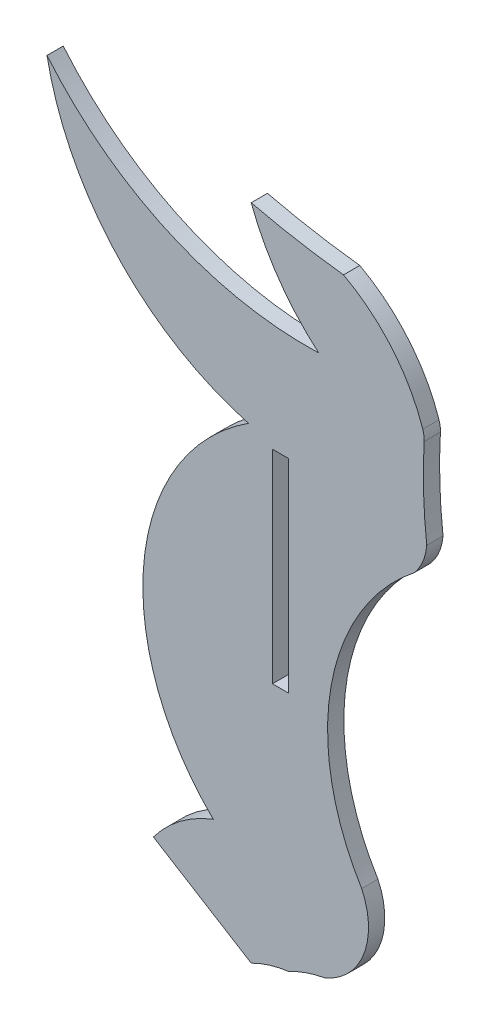
ISO-10303-21;
HEADER;
FILE_DESCRIPTION(('STEP AP214'),'2;1');
FILE_NAME('part.step','',(''),(''),'','','');
FILE_SCHEMA(('AUTOMOTIVE_DESIGN { 1 0 10303 214 1 1 1 1 }'));
ENDSEC;
DATA;
#1=APPLICATION_CONTEXT('core data for automotive mechanical design processes');
#2=APPLICATION_PROTOCOL_DEFINITION('international standard','automotive_design',2000,#1);
#3=PRODUCT_CONTEXT('',#1,'mechanical');
#4=PRODUCT('Part','Part','',(#3));
#5=PRODUCT_RELATED_PRODUCT_CATEGORY('part','',(#4));
#6=PRODUCT_DEFINITION_FORMATION('','',#4);
#7=PRODUCT_DEFINITION_CONTEXT('part definition',#1,'design');
#8=PRODUCT_DEFINITION('design','',#6,#7);
#9=PRODUCT_DEFINITION_SHAPE('','',#8);
#10=(LENGTH_UNIT() NAMED_UNIT(*) SI_UNIT(.MILLI.,.METRE.));
#11=(NAMED_UNIT(*) PLANE_ANGLE_UNIT() SI_UNIT($,.RADIAN.));
#12=(NAMED_UNIT(*) SI_UNIT($,.STERADIAN.) SOLID_ANGLE_UNIT());
#13=UNCERTAINTY_MEASURE_WITH_UNIT(LENGTH_MEASURE(1.E-05),#10,'distance_accuracy_value','');
#14=(GEOMETRIC_REPRESENTATION_CONTEXT(3) GLOBAL_UNCERTAINTY_ASSIGNED_CONTEXT((#13)) GLOBAL_UNIT_ASSIGNED_CONTEXT((#10,
#11,#12)) REPRESENTATION_CONTEXT('',''));
#15=CARTESIAN_POINT('',(0.,0.,0.));
#16=DIRECTION('',(0.,0.,1.));
#17=DIRECTION('',(1.,0.,0.));
#18=AXIS2_PLACEMENT_3D('',#15,#16,#17);
#19=CARTESIAN_POINT('',(9.55454090485293,-191.285070847435,1.524));
#20=DIRECTION('',(0.,0.,1.));
#21=DIRECTION('',(1.,0.,0.));
#22=AXIS2_PLACEMENT_3D('',#19,#20,#21);
#23=PLANE('',#22);
#24=CARTESIAN_POINT('',(9.55454090485293,-191.285070847435,1.524));
#25=DIRECTION('',(0.,0.,1.));
#26=DIRECTION('',(1.,0.,0.));
#27=AXIS2_PLACEMENT_3D('',#24,#25,#26);
#28=CIRCLE('',#27,21.7056422782127);
#29=CARTESIAN_POINT('',(-2.25421514068314,-173.072762169874,1.524));
#30=VERTEX_POINT('',#29);
#31=CARTESIAN_POINT('',(-5.54862103241916,-206.874471291527,1.524));
#32=VERTEX_POINT('',#31);
#33=EDGE_CURVE('E206',#30,#32,#28,.T.);
#34=ORIENTED_EDGE('',*,*,#33,.T.);
#35=CARTESIAN_POINT('',(-1.05625421100928,-218.650257011627,1.524));
#36=DIRECTION('',(0.,0.,1.));
#37=DIRECTION('',(1.,0.,0.));
#38=AXIS2_PLACEMENT_3D('',#35,#36,#37);
#39=CIRCLE('',#38,12.6035903211671);
#40=CARTESIAN_POINT('',(-11.1636350603326,-211.120891742858,1.524));
#41=VERTEX_POINT('',#40);
#42=EDGE_CURVE('E209',#32,#41,#39,.T.);
#43=ORIENTED_EDGE('',*,*,#42,.T.);
#44=DIRECTION('',(0.850986149629736,-0.525188131185728,0.));
#45=VECTOR('',#44,1.);
#46=CARTESIAN_POINT('',(-11.1636350603326,-211.120891742858,1.524));
#47=LINE('',#46,#45);
#48=CARTESIAN_POINT('',(-1.99294998058961,-216.78060190479,1.524));
#49=VERTEX_POINT('',#48);
#50=EDGE_CURVE('E212',#41,#49,#47,.T.);
#51=ORIENTED_EDGE('',*,*,#50,.T.);
#52=CARTESIAN_POINT('',(2.86907927883287,-226.347107534115,1.524));
#53=DIRECTION('',(0.,0.,-1.));
#54=DIRECTION('',(-1.,0.,0.));
#55=AXIS2_PLACEMENT_3D('',#52,#53,#54);
#56=CIRCLE('',#55,10.7311396633995);
#57=CARTESIAN_POINT('',(1.524,-215.700600115763,1.524));
#58=VERTEX_POINT('',#57);
#59=EDGE_CURVE('E214',#49,#58,#56,.T.);
#60=ORIENTED_EDGE('',*,*,#59,.T.);
#61=CARTESIAN_POINT('',(6.91537361239495,-225.789435181501,1.524));
#62=DIRECTION('',(0.,0.,-1.));
#63=DIRECTION('',(1.,0.,0.));
#64=AXIS2_PLACEMENT_3D('',#61,#62,#63);
#65=CIRCLE('',#64,11.4390341555616);
#66=CARTESIAN_POINT('',(4.91126657872368,-214.527328033649,1.524));
#67=VERTEX_POINT('',#66);
#68=EDGE_CURVE('E216',#58,#67,#65,.T.);
#69=ORIENTED_EDGE('',*,*,#68,.T.);
#70=CARTESIAN_POINT('',(2.37198795819861,-208.395239811144,1.524));
#71=DIRECTION('',(0.,0.,1.));
#72=DIRECTION('',(-1.,0.,0.));
#73=AXIS2_PLACEMENT_3D('',#70,#71,#72);
#74=CIRCLE('',#73,6.6370506914778);
#75=CARTESIAN_POINT('',(8.36625056807107,-205.545808702109,1.524));
#76=VERTEX_POINT('',#75);
#77=EDGE_CURVE('E218',#67,#76,#74,.T.);
#78=ORIENTED_EDGE('',*,*,#77,.T.);
#79=CARTESIAN_POINT('',(26.6766710158439,-194.264083119779,1.524));
#80=DIRECTION('',(0.,0.,-1.));
#81=DIRECTION('',(1.,0.,0.));
#82=AXIS2_PLACEMENT_3D('',#79,#80,#81);
#83=CIRCLE('',#82,21.5069483909087);
#84=CARTESIAN_POINT('',(13.3114033214699,-177.414203341368,1.524));
#85=VERTEX_POINT('',#84);
#86=EDGE_CURVE('E220',#76,#85,#83,.T.);
#87=ORIENTED_EDGE('',*,*,#86,.T.);
#88=CARTESIAN_POINT('',(9.55284362416833,-174.220966814508,1.524));
#89=DIRECTION('',(0.,0.,1.));
#90=DIRECTION('',(-1.,0.,0.));
#91=AXIS2_PLACEMENT_3D('',#88,#89,#90);
#92=CIRCLE('',#91,4.93188914257544);
#93=CARTESIAN_POINT('',(14.4684042680822,-174.621958174336,1.524));
#94=VERTEX_POINT('',#93);
#95=EDGE_CURVE('E222',#85,#94,#92,.T.);
#96=ORIENTED_EDGE('',*,*,#95,.T.);
#97=CARTESIAN_POINT('',(63.0675660835477,-169.034269570915,1.524));
#98=DIRECTION('',(0.,0.,-1.));
#99=DIRECTION('',(1.,0.,0.));
#100=AXIS2_PLACEMENT_3D('',#97,#98,#99);
#101=CIRCLE('',#100,48.9193294424055);
#102=CARTESIAN_POINT('',(14.2231544027315,-166.327936138102,1.524));
#103=VERTEX_POINT('',#102);
#104=EDGE_CURVE('E224',#94,#103,#101,.T.);
#105=ORIENTED_EDGE('',*,*,#104,.T.);
#106=CARTESIAN_POINT('',(11.6870442989541,-166.187417308475,1.524));
#107=DIRECTION('',(0.,0.,1.));
#108=DIRECTION('',(1.,0.,0.));
#109=AXIS2_PLACEMENT_3D('',#106,#107,#108);
#110=CIRCLE('',#109,2.53999999999246);
#111=CARTESIAN_POINT('',(14.0945005026066,-165.377630529468,1.524));
#112=VERTEX_POINT('',#111);
#113=EDGE_CURVE('E226',#103,#112,#110,.T.);
#114=ORIENTED_EDGE('',*,*,#113,.T.);
#115=CARTESIAN_POINT('',(-0.795742059191459,-170.386204120323,1.524));
#116=DIRECTION('',(0.,0.,1.));
#117=DIRECTION('',(-1.,0.,0.));
#118=AXIS2_PLACEMENT_3D('',#115,#116,#117);
#119=CIRCLE('',#118,15.7100328759744);
#120=CARTESIAN_POINT('',(6.66463399306705,-156.560578560405,1.524));
#121=VERTEX_POINT('',#120);
#122=EDGE_CURVE('E228',#112,#121,#119,.T.);
#123=ORIENTED_EDGE('',*,*,#122,.T.);
#124=CARTESIAN_POINT('',(15.1562114467351,-83.2693623241411,1.524));
#125=DIRECTION('',(0.,0.,-1.));
#126=DIRECTION('',(1.,0.,0.));
#127=AXIS2_PLACEMENT_3D('',#124,#125,#126);
#128=CIRCLE('',#127,73.7814967660753);
#129=CARTESIAN_POINT('',(-1.99294998058962,-155.03018399852,1.524));
#130=VERTEX_POINT('',#129);
#131=EDGE_CURVE('E230',#121,#130,#128,.T.);
#132=ORIENTED_EDGE('',*,*,#131,.T.);
#133=CARTESIAN_POINT('',(18.7780162943686,-147.215121239974,1.524));
#134=DIRECTION('',(0.,0.,1.));
#135=DIRECTION('',(-1.,0.,0.));
#136=AXIS2_PLACEMENT_3D('',#133,#134,#135);
#137=CIRCLE('',#136,22.1925268033058);
#138=CARTESIAN_POINT('',(4.33054086219458,-164.06085362394,1.524));
#139=VERTEX_POINT('',#138);
#140=EDGE_CURVE('E232',#130,#139,#137,.T.);
#141=ORIENTED_EDGE('',*,*,#140,.T.);
#142=CARTESIAN_POINT('',(3.23415918320192,-132.391414568045,1.524));
#143=DIRECTION('',(0.,0.,-1.));
#144=DIRECTION('',(1.,0.,0.));
#145=AXIS2_PLACEMENT_3D('',#142,#143,#144);
#146=CIRCLE('',#145,31.6884114922331);
#147=CARTESIAN_POINT('',(-21.1397618321882,-152.641535487106,1.524));
#148=VERTEX_POINT('',#147);
#149=EDGE_CURVE('E234',#139,#148,#146,.T.);
#150=ORIENTED_EDGE('',*,*,#149,.T.);
#151=CARTESIAN_POINT('',(4.7413016089885,-147.662461796435,1.524));
#152=DIRECTION('',(0.,0.,1.));
#153=DIRECTION('',(-1.,0.,0.));
#154=AXIS2_PLACEMENT_3D('',#151,#152,#153);
#155=CIRCLE('',#154,26.3556563125138);
#156=EDGE_CURVE('E236',#148,#30,#155,.T.);
#157=ORIENTED_EDGE('',*,*,#156,.T.);
#158=EDGE_LOOP('',(#34,#43,#51,#60,#69,#78,#87,#96,#105,#114,#123,#132,#141,#150,#157));
#159=FACE_BOUND('',#158,.T.);
#160=DIRECTION('',(-1.,0.,0.));
#161=VECTOR('',#160,1.);
#162=CARTESIAN_POINT('',(1.52400000000001,-174.049694422532,1.524));
#163=LINE('',#162,#161);
#164=CARTESIAN_POINT('',(1.52400000000001,-174.049694422532,1.524));
#165=VERTEX_POINT('',#164);
#166=CARTESIAN_POINT('',(0.,-174.049694422532,1.524));
#167=VERTEX_POINT('',#166);
#168=EDGE_CURVE('E178',#165,#167,#163,.T.);
#169=ORIENTED_EDGE('',*,*,#168,.F.);
#170=DIRECTION('',(0.,1.,0.));
#171=VECTOR('',#170,1.);
#172=CARTESIAN_POINT('',(1.52400000000001,-174.049694422532,1.524));
#173=LINE('',#172,#171);
#174=CARTESIAN_POINT('',(1.52400000000001,-193.099694422531,1.524));
#175=VERTEX_POINT('',#174);
#176=EDGE_CURVE('E170',#175,#165,#173,.T.);
#177=ORIENTED_EDGE('',*,*,#176,.F.);
#178=DIRECTION('',(1.,0.,0.));
#179=VECTOR('',#178,1.);
#180=CARTESIAN_POINT('',(1.52400000000001,-193.099694422531,1.524));
#181=LINE('',#180,#179);
#182=CARTESIAN_POINT('',(0.,-193.099694422531,1.524));
#183=VERTEX_POINT('',#182);
#184=EDGE_CURVE('E192',#183,#175,#181,.T.);
#185=ORIENTED_EDGE('',*,*,#184,.F.);
#186=DIRECTION('',(0.,-1.,0.));
#187=VECTOR('',#186,1.);
#188=CARTESIAN_POINT('',(0.,-174.049694422532,1.524));
#189=LINE('',#188,#187);
#190=EDGE_CURVE('E190',#167,#183,#189,.T.);
#191=ORIENTED_EDGE('',*,*,#190,.F.);
#192=EDGE_LOOP('',(#169,#177,#185,#191));
#193=FACE_BOUND('',#192,.T.);
#194=ADVANCED_FACE('F39',(#159,#193),#23,.T.);
#195=CARTESIAN_POINT('',(9.55454090485293,-191.285070847435,0.));
#196=DIRECTION('',(0.,0.,1.));
#197=DIRECTION('',(1.,0.,0.));
#198=AXIS2_PLACEMENT_3D('',#195,#196,#197);
#199=PLANE('',#198);
#200=CARTESIAN_POINT('',(9.55454090485293,-191.285070847435,0.));
#201=DIRECTION('',(0.,0.,1.));
#202=DIRECTION('',(1.,0.,0.));
#203=AXIS2_PLACEMENT_3D('',#200,#201,#202);
#204=CIRCLE('',#203,21.7056422782127);
#205=CARTESIAN_POINT('',(-2.25421514068314,-173.072762169874,0.));
#206=VERTEX_POINT('',#205);
#207=CARTESIAN_POINT('',(-5.54862103241916,-206.874471291527,0.));
#208=VERTEX_POINT('',#207);
#209=EDGE_CURVE('E186',#206,#208,#204,.T.);
#210=ORIENTED_EDGE('',*,*,#209,.F.);
#211=CARTESIAN_POINT('',(4.7413016089885,-147.662461796435,0.));
#212=DIRECTION('',(0.,0.,1.));
#213=DIRECTION('',(-1.,0.,0.));
#214=AXIS2_PLACEMENT_3D('',#211,#212,#213);
#215=CIRCLE('',#214,26.3556563125138);
#216=CARTESIAN_POINT('',(-21.1397618321882,-152.641535487106,0.));
#217=VERTEX_POINT('',#216);
#218=EDGE_CURVE('E210',#217,#206,#215,.T.);
#219=ORIENTED_EDGE('',*,*,#218,.F.);
#220=CARTESIAN_POINT('',(3.23415918320192,-132.391414568045,0.));
#221=DIRECTION('',(0.,0.,-1.));
#222=DIRECTION('',(1.,0.,0.));
#223=AXIS2_PLACEMENT_3D('',#220,#221,#222);
#224=CIRCLE('',#223,31.6884114922331);
#225=CARTESIAN_POINT('',(4.33054086219458,-164.06085362394,0.));
#226=VERTEX_POINT('',#225);
#227=EDGE_CURVE('E265',#226,#217,#224,.T.);
#228=ORIENTED_EDGE('',*,*,#227,.F.);
#229=CARTESIAN_POINT('',(18.7780162943686,-147.215121239974,0.));
#230=DIRECTION('',(0.,0.,1.));
#231=DIRECTION('',(-1.,0.,0.));
#232=AXIS2_PLACEMENT_3D('',#229,#230,#231);
#233=CIRCLE('',#232,22.1925268033058);
#234=CARTESIAN_POINT('',(-1.99294998058962,-155.03018399852,0.));
#235=VERTEX_POINT('',#234);
#236=EDGE_CURVE('E263',#235,#226,#233,.T.);
#237=ORIENTED_EDGE('',*,*,#236,.F.);
#238=CARTESIAN_POINT('',(15.1562114467351,-83.2693623241411,0.));
#239=DIRECTION('',(0.,0.,-1.));
#240=DIRECTION('',(1.,0.,0.));
#241=AXIS2_PLACEMENT_3D('',#238,#239,#240);
#242=CIRCLE('',#241,73.7814967660753);
#243=CARTESIAN_POINT('',(6.66463399306705,-156.560578560405,0.));
#244=VERTEX_POINT('',#243);
#245=EDGE_CURVE('E261',#244,#235,#242,.T.);
#246=ORIENTED_EDGE('',*,*,#245,.F.);
#247=CARTESIAN_POINT('',(-0.795742059191459,-170.386204120323,0.));
#248=DIRECTION('',(0.,0.,1.));
#249=DIRECTION('',(-1.,0.,0.));
#250=AXIS2_PLACEMENT_3D('',#247,#248,#249);
#251=CIRCLE('',#250,15.7100328759744);
#252=CARTESIAN_POINT('',(14.0945005026066,-165.377630529468,0.));
#253=VERTEX_POINT('',#252);
#254=EDGE_CURVE('E259',#253,#244,#251,.T.);
#255=ORIENTED_EDGE('',*,*,#254,.F.);
#256=CARTESIAN_POINT('',(11.6870442989541,-166.187417308475,0.));
#257=DIRECTION('',(0.,0.,1.));
#258=DIRECTION('',(1.,0.,0.));
#259=AXIS2_PLACEMENT_3D('',#256,#257,#258);
#260=CIRCLE('',#259,2.53999999999246);
#261=CARTESIAN_POINT('',(14.2231544027315,-166.327936138102,0.));
#262=VERTEX_POINT('',#261);
#263=EDGE_CURVE('E257',#262,#253,#260,.T.);
#264=ORIENTED_EDGE('',*,*,#263,.F.);
#265=CARTESIAN_POINT('',(63.0675660835477,-169.034269570915,0.));
#266=DIRECTION('',(0.,0.,-1.));
#267=DIRECTION('',(1.,0.,0.));
#268=AXIS2_PLACEMENT_3D('',#265,#266,#267);
#269=CIRCLE('',#268,48.9193294424055);
#270=CARTESIAN_POINT('',(14.4684042680822,-174.621958174336,0.));
#271=VERTEX_POINT('',#270);
#272=EDGE_CURVE('E255',#271,#262,#269,.T.);
#273=ORIENTED_EDGE('',*,*,#272,.F.);
#274=CARTESIAN_POINT('',(9.55284362416833,-174.220966814508,0.));
#275=DIRECTION('',(0.,0.,1.));
#276=DIRECTION('',(-1.,0.,0.));
#277=AXIS2_PLACEMENT_3D('',#274,#275,#276);
#278=CIRCLE('',#277,4.93188914257544);
#279=CARTESIAN_POINT('',(13.3114033214699,-177.414203341368,0.));
#280=VERTEX_POINT('',#279);
#281=EDGE_CURVE('E253',#280,#271,#278,.T.);
#282=ORIENTED_EDGE('',*,*,#281,.F.);
#283=CARTESIAN_POINT('',(26.6766710158439,-194.264083119779,0.));
#284=DIRECTION('',(0.,0.,-1.));
#285=DIRECTION('',(1.,0.,0.));
#286=AXIS2_PLACEMENT_3D('',#283,#284,#285);
#287=CIRCLE('',#286,21.5069483909087);
#288=CARTESIAN_POINT('',(8.36625056807107,-205.545808702109,0.));
#289=VERTEX_POINT('',#288);
#290=EDGE_CURVE('E251',#289,#280,#287,.T.);
#291=ORIENTED_EDGE('',*,*,#290,.F.);
#292=CARTESIAN_POINT('',(2.37198795819861,-208.395239811144,0.));
#293=DIRECTION('',(0.,0.,1.));
#294=DIRECTION('',(-1.,0.,0.));
#295=AXIS2_PLACEMENT_3D('',#292,#293,#294);
#296=CIRCLE('',#295,6.6370506914778);
#297=CARTESIAN_POINT('',(4.91126657872368,-214.527328033649,0.));
#298=VERTEX_POINT('',#297);
#299=EDGE_CURVE('E249',#298,#289,#296,.T.);
#300=ORIENTED_EDGE('',*,*,#299,.F.);
#301=CARTESIAN_POINT('',(6.91537361239495,-225.789435181501,0.));
#302=DIRECTION('',(0.,0.,-1.));
#303=DIRECTION('',(1.,0.,0.));
#304=AXIS2_PLACEMENT_3D('',#301,#302,#303);
#305=CIRCLE('',#304,11.4390341555616);
#306=CARTESIAN_POINT('',(1.524,-215.700600115763,0.));
#307=VERTEX_POINT('',#306);
#308=EDGE_CURVE('E247',#307,#298,#305,.T.);
#309=ORIENTED_EDGE('',*,*,#308,.F.);
#310=CARTESIAN_POINT('',(2.86907927883287,-226.347107534115,0.));
#311=DIRECTION('',(0.,0.,-1.));
#312=DIRECTION('',(-1.,0.,0.));
#313=AXIS2_PLACEMENT_3D('',#310,#311,#312);
#314=CIRCLE('',#313,10.7311396633995);
#315=CARTESIAN_POINT('',(-1.99294998058961,-216.78060190479,0.));
#316=VERTEX_POINT('',#315);
#317=EDGE_CURVE('E245',#316,#307,#314,.T.);
#318=ORIENTED_EDGE('',*,*,#317,.F.);
#319=DIRECTION('',(0.850986149629736,-0.525188131185728,0.));
#320=VECTOR('',#319,1.);
#321=CARTESIAN_POINT('',(-11.1636350603326,-211.120891742858,0.));
#322=LINE('',#321,#320);
#323=CARTESIAN_POINT('',(-11.1636350603326,-211.120891742858,0.));
#324=VERTEX_POINT('',#323);
#325=EDGE_CURVE('E243',#324,#316,#322,.T.);
#326=ORIENTED_EDGE('',*,*,#325,.F.);
#327=CARTESIAN_POINT('',(-1.05625421100928,-218.650257011627,0.));
#328=DIRECTION('',(0.,0.,1.));
#329=DIRECTION('',(1.,0.,0.));
#330=AXIS2_PLACEMENT_3D('',#327,#328,#329);
#331=CIRCLE('',#330,12.6035903211671);
#332=EDGE_CURVE('E241',#208,#324,#331,.T.);
#333=ORIENTED_EDGE('',*,*,#332,.F.);
#334=EDGE_LOOP('',(#210,#219,#228,#237,#246,#255,#264,#273,#282,#291,#300,#309,#318,#326,#333));
#335=FACE_BOUND('',#334,.T.);
#336=DIRECTION('',(0.,1.,0.));
#337=VECTOR('',#336,1.);
#338=CARTESIAN_POINT('',(1.52400000000001,-174.049694422532,0.));
#339=LINE('',#338,#337);
#340=CARTESIAN_POINT('',(1.52400000000001,-193.099694422531,0.));
#341=VERTEX_POINT('',#340);
#342=CARTESIAN_POINT('',(1.52400000000001,-174.049694422532,0.));
#343=VERTEX_POINT('',#342);
#344=EDGE_CURVE('E62',#341,#343,#339,.T.);
#345=ORIENTED_EDGE('',*,*,#344,.T.);
#346=DIRECTION('',(-1.,0.,0.));
#347=VECTOR('',#346,1.);
#348=CARTESIAN_POINT('',(1.52400000000001,-174.049694422532,0.));
#349=LINE('',#348,#347);
#350=CARTESIAN_POINT('',(0.,-174.049694422532,0.));
#351=VERTEX_POINT('',#350);
#352=EDGE_CURVE('E185',#343,#351,#349,.T.);
#353=ORIENTED_EDGE('',*,*,#352,.T.);
#354=DIRECTION('',(0.,-1.,0.));
#355=VECTOR('',#354,1.);
#356=CARTESIAN_POINT('',(0.,-174.049694422532,0.));
#357=LINE('',#356,#355);
#358=CARTESIAN_POINT('',(0.,-193.099694422531,0.));
#359=VERTEX_POINT('',#358);
#360=EDGE_CURVE('E198',#351,#359,#357,.T.);
#361=ORIENTED_EDGE('',*,*,#360,.T.);
#362=DIRECTION('',(1.,0.,0.));
#363=VECTOR('',#362,1.);
#364=CARTESIAN_POINT('',(1.52400000000001,-193.099694422531,0.));
#365=LINE('',#364,#363);
#366=EDGE_CURVE('E179',#359,#341,#365,.T.);
#367=ORIENTED_EDGE('',*,*,#366,.T.);
#368=EDGE_LOOP('',(#345,#353,#361,#367));
#369=FACE_BOUND('',#368,.T.);
#370=ADVANCED_FACE('F316',(#335,#369),#199,.F.);
#371=CARTESIAN_POINT('',(9.55454090485293,-191.285070847435,1.524));
#372=DIRECTION('',(0.,0.,-1.));
#373=DIRECTION('',(-1.,0.,0.));
#374=AXIS2_PLACEMENT_3D('',#371,#372,#373);
#375=CYLINDRICAL_SURFACE('',#374,21.7056422782127);
#376=ORIENTED_EDGE('',*,*,#209,.T.);
#377=DIRECTION('',(0.,0.,-1.));
#378=VECTOR('',#377,1.);
#379=CARTESIAN_POINT('',(-5.54862103241916,-206.874471291527,1.524));
#380=LINE('',#379,#378);
#381=EDGE_CURVE('E11',#32,#208,#380,.T.);
#382=ORIENTED_EDGE('',*,*,#381,.F.);
#383=ORIENTED_EDGE('',*,*,#33,.F.);
#384=DIRECTION('',(0.,0.,-1.));
#385=VECTOR('',#384,1.);
#386=CARTESIAN_POINT('',(-2.25421514068314,-173.072762169874,1.524));
#387=LINE('',#386,#385);
#388=EDGE_CURVE('E238',#30,#206,#387,.T.);
#389=ORIENTED_EDGE('',*,*,#388,.T.);
#390=EDGE_LOOP('',(#376,#382,#383,#389));
#391=FACE_BOUND('',#390,.T.);
#392=ADVANCED_FACE('F41',(#391),#375,.T.);
#393=CARTESIAN_POINT('',(-1.05625421100928,-218.650257011627,1.524));
#394=DIRECTION('',(0.,0.,-1.));
#395=DIRECTION('',(-1.,0.,0.));
#396=AXIS2_PLACEMENT_3D('',#393,#394,#395);
#397=CYLINDRICAL_SURFACE('',#396,12.6035903211671);
#398=ORIENTED_EDGE('',*,*,#332,.T.);
#399=DIRECTION('',(0.,0.,-1.));
#400=VECTOR('',#399,1.);
#401=CARTESIAN_POINT('',(-11.1636350603326,-211.120891742858,1.524));
#402=LINE('',#401,#400);
#403=EDGE_CURVE('E47',#41,#324,#402,.T.);
#404=ORIENTED_EDGE('',*,*,#403,.F.);
#405=ORIENTED_EDGE('',*,*,#42,.F.);
#406=ORIENTED_EDGE('',*,*,#381,.T.);
#407=EDGE_LOOP('',(#398,#404,#405,#406));
#408=FACE_BOUND('',#407,.T.);
#409=ADVANCED_FACE('F333',(#408),#397,.T.);
#410=CARTESIAN_POINT('',(-11.1636350603326,-211.120891742858,1.524));
#411=DIRECTION('',(0.525188131185728,0.850986149629736,0.));
#412=DIRECTION('',(-0.850986149629736,0.525188131185728,0.));
#413=AXIS2_PLACEMENT_3D('',#410,#411,#412);
#414=PLANE('',#413);
#415=ORIENTED_EDGE('',*,*,#325,.T.);
#416=DIRECTION('',(0.,0.,-1.));
#417=VECTOR('',#416,1.);
#418=CARTESIAN_POINT('',(-1.99294998058961,-216.78060190479,1.524));
#419=LINE('',#418,#417);
#420=EDGE_CURVE('E303',#49,#316,#419,.T.);
#421=ORIENTED_EDGE('',*,*,#420,.F.);
#422=ORIENTED_EDGE('',*,*,#50,.F.);
#423=ORIENTED_EDGE('',*,*,#403,.T.);
#424=EDGE_LOOP('',(#415,#421,#422,#423));
#425=FACE_BOUND('',#424,.T.);
#426=ADVANCED_FACE('F310',(#425),#414,.F.);
#427=CARTESIAN_POINT('',(2.86907927883287,-226.347107534115,1.524));
#428=DIRECTION('',(0.,0.,-1.));
#429=DIRECTION('',(-1.,0.,0.));
#430=AXIS2_PLACEMENT_3D('',#427,#428,#429);
#431=CYLINDRICAL_SURFACE('',#430,10.7311396633995);
#432=ORIENTED_EDGE('',*,*,#317,.T.);
#433=DIRECTION('',(0.,0.,-1.));
#434=VECTOR('',#433,1.);
#435=CARTESIAN_POINT('',(1.524,-215.700600115763,1.524));
#436=LINE('',#435,#434);
#437=EDGE_CURVE('E300',#58,#307,#436,.T.);
#438=ORIENTED_EDGE('',*,*,#437,.F.);
#439=ORIENTED_EDGE('',*,*,#59,.F.);
#440=ORIENTED_EDGE('',*,*,#420,.T.);
#441=EDGE_LOOP('',(#432,#438,#439,#440));
#442=FACE_BOUND('',#441,.T.);
#443=ADVANCED_FACE('F322',(#442),#431,.F.);
#444=CARTESIAN_POINT('',(6.91537361239495,-225.789435181501,1.524));
#445=DIRECTION('',(0.,0.,-1.));
#446=DIRECTION('',(-1.,0.,0.));
#447=AXIS2_PLACEMENT_3D('',#444,#445,#446);
#448=CYLINDRICAL_SURFACE('',#447,11.4390341555616);
#449=ORIENTED_EDGE('',*,*,#308,.T.);
#450=DIRECTION('',(0.,0.,-1.));
#451=VECTOR('',#450,1.);
#452=CARTESIAN_POINT('',(4.91126657872368,-214.527328033649,1.524));
#453=LINE('',#452,#451);
#454=EDGE_CURVE('E297',#67,#298,#453,.T.);
#455=ORIENTED_EDGE('',*,*,#454,.F.);
#456=ORIENTED_EDGE('',*,*,#68,.F.);
#457=ORIENTED_EDGE('',*,*,#437,.T.);
#458=EDGE_LOOP('',(#449,#455,#456,#457));
#459=FACE_BOUND('',#458,.T.);
#460=ADVANCED_FACE('F326',(#459),#448,.F.);
#461=CARTESIAN_POINT('',(2.37198795819861,-208.395239811144,1.524));
#462=DIRECTION('',(0.,0.,-1.));
#463=DIRECTION('',(-1.,0.,0.));
#464=AXIS2_PLACEMENT_3D('',#461,#462,#463);
#465=CYLINDRICAL_SURFACE('',#464,6.6370506914778);
#466=ORIENTED_EDGE('',*,*,#299,.T.);
#467=DIRECTION('',(0.,0.,-1.));
#468=VECTOR('',#467,1.);
#469=CARTESIAN_POINT('',(8.36625056807107,-205.545808702109,1.524));
#470=LINE('',#469,#468);
#471=EDGE_CURVE('E294',#76,#289,#470,.T.);
#472=ORIENTED_EDGE('',*,*,#471,.F.);
#473=ORIENTED_EDGE('',*,*,#77,.F.);
#474=ORIENTED_EDGE('',*,*,#454,.T.);
#475=EDGE_LOOP('',(#466,#472,#473,#474));
#476=FACE_BOUND('',#475,.T.);
#477=ADVANCED_FACE('F381',(#476),#465,.T.);
#478=CARTESIAN_POINT('',(26.6766710158439,-194.264083119779,1.524));
#479=DIRECTION('',(0.,0.,-1.));
#480=DIRECTION('',(-1.,0.,0.));
#481=AXIS2_PLACEMENT_3D('',#478,#479,#480);
#482=CYLINDRICAL_SURFACE('',#481,21.5069483909087);
#483=ORIENTED_EDGE('',*,*,#290,.T.);
#484=DIRECTION('',(0.,0.,-1.));
#485=VECTOR('',#484,1.);
#486=CARTESIAN_POINT('',(13.3114033214699,-177.414203341368,1.524));
#487=LINE('',#486,#485);
#488=EDGE_CURVE('E291',#85,#280,#487,.T.);
#489=ORIENTED_EDGE('',*,*,#488,.F.);
#490=ORIENTED_EDGE('',*,*,#86,.F.);
#491=ORIENTED_EDGE('',*,*,#471,.T.);
#492=EDGE_LOOP('',(#483,#489,#490,#491));
#493=FACE_BOUND('',#492,.T.);
#494=ADVANCED_FACE('F379',(#493),#482,.F.);
#495=CARTESIAN_POINT('',(9.55284362416833,-174.220966814508,1.524));
#496=DIRECTION('',(0.,0.,-1.));
#497=DIRECTION('',(-1.,0.,0.));
#498=AXIS2_PLACEMENT_3D('',#495,#496,#497);
#499=CYLINDRICAL_SURFACE('',#498,4.93188914257544);
#500=ORIENTED_EDGE('',*,*,#281,.T.);
#501=DIRECTION('',(0.,0.,-1.));
#502=VECTOR('',#501,1.);
#503=CARTESIAN_POINT('',(14.4684042680822,-174.621958174336,1.524));
#504=LINE('',#503,#502);
#505=EDGE_CURVE('E288',#94,#271,#504,.T.);
#506=ORIENTED_EDGE('',*,*,#505,.F.);
#507=ORIENTED_EDGE('',*,*,#95,.F.);
#508=ORIENTED_EDGE('',*,*,#488,.T.);
#509=EDGE_LOOP('',(#500,#506,#507,#508));
#510=FACE_BOUND('',#509,.T.);
#511=ADVANCED_FACE('F375',(#510),#499,.T.);
#512=CARTESIAN_POINT('',(63.0675660835477,-169.034269570915,1.524));
#513=DIRECTION('',(0.,0.,-1.));
#514=DIRECTION('',(-1.,0.,0.));
#515=AXIS2_PLACEMENT_3D('',#512,#513,#514);
#516=CYLINDRICAL_SURFACE('',#515,48.9193294424055);
#517=ORIENTED_EDGE('',*,*,#272,.T.);
#518=DIRECTION('',(0.,0.,-1.));
#519=VECTOR('',#518,1.);
#520=CARTESIAN_POINT('',(14.2231544027315,-166.327936138102,1.524));
#521=LINE('',#520,#519);
#522=EDGE_CURVE('E285',#103,#262,#521,.T.);
#523=ORIENTED_EDGE('',*,*,#522,.F.);
#524=ORIENTED_EDGE('',*,*,#104,.F.);
#525=ORIENTED_EDGE('',*,*,#505,.T.);
#526=EDGE_LOOP('',(#517,#523,#524,#525));
#527=FACE_BOUND('',#526,.T.);
#528=ADVANCED_FACE('F370',(#527),#516,.F.);
#529=CARTESIAN_POINT('',(11.6870442989541,-166.187417308475,1.524));
#530=DIRECTION('',(0.,0.,-1.));
#531=DIRECTION('',(-1.,0.,0.));
#532=AXIS2_PLACEMENT_3D('',#529,#530,#531);
#533=CYLINDRICAL_SURFACE('',#532,2.53999999999246);
#534=ORIENTED_EDGE('',*,*,#263,.T.);
#535=DIRECTION('',(0.,0.,-1.));
#536=VECTOR('',#535,1.);
#537=CARTESIAN_POINT('',(14.0945005026066,-165.377630529468,1.524));
#538=LINE('',#537,#536);
#539=EDGE_CURVE('E282',#112,#253,#538,.T.);
#540=ORIENTED_EDGE('',*,*,#539,.F.);
#541=ORIENTED_EDGE('',*,*,#113,.F.);
#542=ORIENTED_EDGE('',*,*,#522,.T.);
#543=EDGE_LOOP('',(#534,#540,#541,#542));
#544=FACE_BOUND('',#543,.T.);
#545=ADVANCED_FACE('F364',(#544),#533,.T.);
#546=CARTESIAN_POINT('',(-0.795742059191459,-170.386204120323,1.524));
#547=DIRECTION('',(0.,0.,-1.));
#548=DIRECTION('',(-1.,0.,0.));
#549=AXIS2_PLACEMENT_3D('',#546,#547,#548);
#550=CYLINDRICAL_SURFACE('',#549,15.7100328759744);
#551=ORIENTED_EDGE('',*,*,#254,.T.);
#552=DIRECTION('',(0.,0.,-1.));
#553=VECTOR('',#552,1.);
#554=CARTESIAN_POINT('',(6.66463399306705,-156.560578560405,1.524));
#555=LINE('',#554,#553);
#556=EDGE_CURVE('E279',#121,#244,#555,.T.);
#557=ORIENTED_EDGE('',*,*,#556,.F.);
#558=ORIENTED_EDGE('',*,*,#122,.F.);
#559=ORIENTED_EDGE('',*,*,#539,.T.);
#560=EDGE_LOOP('',(#551,#557,#558,#559));
#561=FACE_BOUND('',#560,.T.);
#562=ADVANCED_FACE('F360',(#561),#550,.T.);
#563=CARTESIAN_POINT('',(15.1562114467351,-83.2693623241411,1.524));
#564=DIRECTION('',(0.,0.,-1.));
#565=DIRECTION('',(-1.,0.,0.));
#566=AXIS2_PLACEMENT_3D('',#563,#564,#565);
#567=CYLINDRICAL_SURFACE('',#566,73.7814967660753);
#568=ORIENTED_EDGE('',*,*,#245,.T.);
#569=DIRECTION('',(0.,0.,-1.));
#570=VECTOR('',#569,1.);
#571=CARTESIAN_POINT('',(-1.99294998058962,-155.03018399852,1.524));
#572=LINE('',#571,#570);
#573=EDGE_CURVE('E276',#130,#235,#572,.T.);
#574=ORIENTED_EDGE('',*,*,#573,.F.);
#575=ORIENTED_EDGE('',*,*,#131,.F.);
#576=ORIENTED_EDGE('',*,*,#556,.T.);
#577=EDGE_LOOP('',(#568,#574,#575,#576));
#578=FACE_BOUND('',#577,.T.);
#579=ADVANCED_FACE('F355',(#578),#567,.F.);
#580=CARTESIAN_POINT('',(18.7780162943686,-147.215121239974,1.524));
#581=DIRECTION('',(0.,0.,-1.));
#582=DIRECTION('',(-1.,0.,0.));
#583=AXIS2_PLACEMENT_3D('',#580,#581,#582);
#584=CYLINDRICAL_SURFACE('',#583,22.1925268033058);
#585=ORIENTED_EDGE('',*,*,#236,.T.);
#586=DIRECTION('',(0.,0.,-1.));
#587=VECTOR('',#586,1.);
#588=CARTESIAN_POINT('',(4.33054086219458,-164.06085362394,1.524));
#589=LINE('',#588,#587);
#590=EDGE_CURVE('E273',#139,#226,#589,.T.);
#591=ORIENTED_EDGE('',*,*,#590,.F.);
#592=ORIENTED_EDGE('',*,*,#140,.F.);
#593=ORIENTED_EDGE('',*,*,#573,.T.);
#594=EDGE_LOOP('',(#585,#591,#592,#593));
#595=FACE_BOUND('',#594,.T.);
#596=ADVANCED_FACE('F349',(#595),#584,.T.);
#597=CARTESIAN_POINT('',(3.23415918320192,-132.391414568045,1.524));
#598=DIRECTION('',(0.,0.,-1.));
#599=DIRECTION('',(-1.,0.,0.));
#600=AXIS2_PLACEMENT_3D('',#597,#598,#599);
#601=CYLINDRICAL_SURFACE('',#600,31.6884114922331);
#602=ORIENTED_EDGE('',*,*,#227,.T.);
#603=DIRECTION('',(0.,0.,-1.));
#604=VECTOR('',#603,1.);
#605=CARTESIAN_POINT('',(-21.1397618321882,-152.641535487106,1.524));
#606=LINE('',#605,#604);
#607=EDGE_CURVE('E270',#148,#217,#606,.T.);
#608=ORIENTED_EDGE('',*,*,#607,.F.);
#609=ORIENTED_EDGE('',*,*,#149,.F.);
#610=ORIENTED_EDGE('',*,*,#590,.T.);
#611=EDGE_LOOP('',(#602,#608,#609,#610));
#612=FACE_BOUND('',#611,.T.);
#613=ADVANCED_FACE('F345',(#612),#601,.F.);
#614=CARTESIAN_POINT('',(4.7413016089885,-147.662461796435,1.524));
#615=DIRECTION('',(0.,0.,-1.));
#616=DIRECTION('',(-1.,0.,0.));
#617=AXIS2_PLACEMENT_3D('',#614,#615,#616);
#618=CYLINDRICAL_SURFACE('',#617,26.3556563125138);
#619=ORIENTED_EDGE('',*,*,#218,.T.);
#620=ORIENTED_EDGE('',*,*,#388,.F.);
#621=ORIENTED_EDGE('',*,*,#156,.F.);
#622=ORIENTED_EDGE('',*,*,#607,.T.);
#623=EDGE_LOOP('',(#619,#620,#621,#622));
#624=FACE_BOUND('',#623,.T.);
#625=ADVANCED_FACE('F340',(#624),#618,.T.);
#626=CARTESIAN_POINT('',(1.52400000000001,-174.049694422532,1.524));
#627=DIRECTION('',(-1.,0.,0.));
#628=DIRECTION('',(0.,0.,1.));
#629=AXIS2_PLACEMENT_3D('',#626,#627,#628);
#630=PLANE('',#629);
#631=ORIENTED_EDGE('',*,*,#344,.F.);
#632=DIRECTION('',(0.,0.,-1.));
#633=VECTOR('',#632,1.);
#634=CARTESIAN_POINT('',(1.52400000000001,-193.099694422531,1.524));
#635=LINE('',#634,#633);
#636=EDGE_CURVE('E174',#175,#341,#635,.T.);
#637=ORIENTED_EDGE('',*,*,#636,.F.);
#638=ORIENTED_EDGE('',*,*,#176,.T.);
#639=DIRECTION('',(0.,0.,-1.));
#640=VECTOR('',#639,1.);
#641=CARTESIAN_POINT('',(1.52400000000001,-174.049694422532,1.524));
#642=LINE('',#641,#640);
#643=EDGE_CURVE('E173',#165,#343,#642,.T.);
#644=ORIENTED_EDGE('',*,*,#643,.T.);
#645=EDGE_LOOP('',(#631,#637,#638,#644));
#646=FACE_BOUND('',#645,.T.);
#647=ADVANCED_FACE('F172',(#646),#630,.T.);
#648=CARTESIAN_POINT('',(1.52400000000001,-174.049694422532,1.524));
#649=DIRECTION('',(0.,-1.,0.));
#650=DIRECTION('',(0.,0.,-1.));
#651=AXIS2_PLACEMENT_3D('',#648,#649,#650);
#652=PLANE('',#651);
#653=ORIENTED_EDGE('',*,*,#352,.F.);
#654=ORIENTED_EDGE('',*,*,#643,.F.);
#655=ORIENTED_EDGE('',*,*,#168,.T.);
#656=DIRECTION('',(0.,0.,-1.));
#657=VECTOR('',#656,1.);
#658=CARTESIAN_POINT('',(0.,-174.049694422532,1.524));
#659=LINE('',#658,#657);
#660=EDGE_CURVE('E187',#167,#351,#659,.T.);
#661=ORIENTED_EDGE('',*,*,#660,.T.);
#662=EDGE_LOOP('',(#653,#654,#655,#661));
#663=FACE_BOUND('',#662,.T.);
#664=ADVANCED_FACE('F182',(#663),#652,.T.);
#665=CARTESIAN_POINT('',(0.,-174.049694422532,1.524));
#666=DIRECTION('',(1.,0.,0.));
#667=DIRECTION('',(0.,0.,-1.));
#668=AXIS2_PLACEMENT_3D('',#665,#666,#667);
#669=PLANE('',#668);
#670=ORIENTED_EDGE('',*,*,#360,.F.);
#671=ORIENTED_EDGE('',*,*,#660,.F.);
#672=ORIENTED_EDGE('',*,*,#190,.T.);
#673=DIRECTION('',(0.,0.,-1.));
#674=VECTOR('',#673,1.);
#675=CARTESIAN_POINT('',(0.,-193.099694422531,1.524));
#676=LINE('',#675,#674);
#677=EDGE_CURVE('E54',#183,#359,#676,.T.);
#678=ORIENTED_EDGE('',*,*,#677,.T.);
#679=EDGE_LOOP('',(#670,#671,#672,#678));
#680=FACE_BOUND('',#679,.T.);
#681=ADVANCED_FACE('F457',(#680),#669,.T.);
#682=CARTESIAN_POINT('',(1.52400000000001,-193.099694422531,1.524));
#683=DIRECTION('',(0.,1.,0.));
#684=DIRECTION('',(0.,0.,1.));
#685=AXIS2_PLACEMENT_3D('',#682,#683,#684);
#686=PLANE('',#685);
#687=ORIENTED_EDGE('',*,*,#366,.F.);
#688=ORIENTED_EDGE('',*,*,#677,.F.);
#689=ORIENTED_EDGE('',*,*,#184,.T.);
#690=ORIENTED_EDGE('',*,*,#636,.T.);
#691=EDGE_LOOP('',(#687,#688,#689,#690));
#692=FACE_BOUND('',#691,.T.);
#693=ADVANCED_FACE('F463',(#692),#686,.T.);
#694=CLOSED_SHELL('',(#194,#370,#392,#409,#426,#443,#460,#477,#494,#511,#528,#545,#562,#579,
#596,#613,#625,#647,#664,#681,#693));
#695=MANIFOLD_SOLID_BREP('B2',#694);
#696=ADVANCED_BREP_SHAPE_REPRESENTATION('',(#18,#695),#14);
#697=SHAPE_DEFINITION_REPRESENTATION(#9,#696);
ENDSEC;
END-ISO-10303-21;
